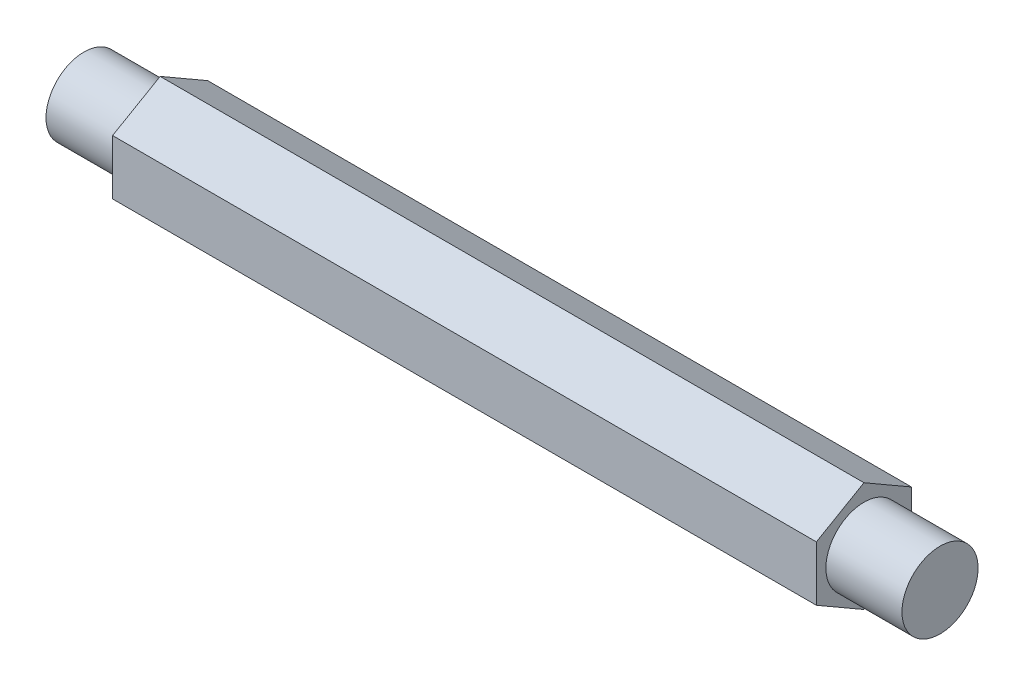
ISO-10303-21;
HEADER;
FILE_DESCRIPTION(('STEP AP214'),'2;1');
FILE_NAME('part.step','',(''),(''),'','','');
FILE_SCHEMA(('AUTOMOTIVE_DESIGN { 1 0 10303 214 1 1 1 1 }'));
ENDSEC;
DATA;
#1=APPLICATION_CONTEXT('core data for automotive mechanical design processes');
#2=APPLICATION_PROTOCOL_DEFINITION('international standard','automotive_design',2000,#1);
#3=PRODUCT_CONTEXT('',#1,'mechanical');
#4=PRODUCT('Part','Part','',(#3));
#5=PRODUCT_RELATED_PRODUCT_CATEGORY('part','',(#4));
#6=PRODUCT_DEFINITION_FORMATION('','',#4);
#7=PRODUCT_DEFINITION_CONTEXT('part definition',#1,'design');
#8=PRODUCT_DEFINITION('design','',#6,#7);
#9=PRODUCT_DEFINITION_SHAPE('','',#8);
#10=(LENGTH_UNIT() NAMED_UNIT(*) SI_UNIT(.MILLI.,.METRE.));
#11=(NAMED_UNIT(*) PLANE_ANGLE_UNIT() SI_UNIT($,.RADIAN.));
#12=(NAMED_UNIT(*) SI_UNIT($,.STERADIAN.) SOLID_ANGLE_UNIT());
#13=UNCERTAINTY_MEASURE_WITH_UNIT(LENGTH_MEASURE(1.E-05),#10,'distance_accuracy_value','');
#14=(GEOMETRIC_REPRESENTATION_CONTEXT(3) GLOBAL_UNCERTAINTY_ASSIGNED_CONTEXT((#13)) GLOBAL_UNIT_ASSIGNED_CONTEXT((#10,
#11,#12)) REPRESENTATION_CONTEXT('',''));
#15=CARTESIAN_POINT('',(0.,0.,0.));
#16=DIRECTION('',(0.,0.,1.));
#17=DIRECTION('',(1.,0.,0.));
#18=AXIS2_PLACEMENT_3D('',#15,#16,#17);
#19=CARTESIAN_POINT('',(0.,2.5,0.));
#20=DIRECTION('',(1.,0.,0.));
#21=DIRECTION('',(0.,0.,-1.));
#22=AXIS2_PLACEMENT_3D('',#19,#20,#21);
#23=PLANE('',#22);
#24=CARTESIAN_POINT('',(0.,0.,0.));
#25=DIRECTION('',(-1.,0.,0.));
#26=DIRECTION('',(0.,0.,1.));
#27=AXIS2_PLACEMENT_3D('',#24,#25,#26);
#28=CIRCLE('',#27,2.);
#29=CARTESIAN_POINT('',(0.,0.,2.));
#30=VERTEX_POINT('',#29);
#31=EDGE_CURVE('E123',#30,#30,#28,.T.);
#32=ORIENTED_EDGE('',*,*,#31,.F.);
#33=EDGE_LOOP('',(#32));
#34=FACE_BOUND('',#33,.T.);
#35=DIRECTION('',(0.,-1.,0.));
#36=VECTOR('',#35,1.);
#37=CARTESIAN_POINT('',(0.,1.44337567297406,2.5));
#38=LINE('',#37,#36);
#39=CARTESIAN_POINT('',(0.,1.44337567297406,2.5));
#40=VERTEX_POINT('',#39);
#41=CARTESIAN_POINT('',(0.,-1.44337567297406,2.5));
#42=VERTEX_POINT('',#41);
#43=EDGE_CURVE('E98',#40,#42,#38,.T.);
#44=ORIENTED_EDGE('',*,*,#43,.F.);
#45=DIRECTION('',(0.,-0.5,0.866025403784439));
#46=VECTOR('',#45,1.);
#47=CARTESIAN_POINT('',(0.,2.88675134594813,0.));
#48=LINE('',#47,#46);
#49=CARTESIAN_POINT('',(0.,2.88675134594813,0.));
#50=VERTEX_POINT('',#49);
#51=EDGE_CURVE('E93',#50,#40,#48,.T.);
#52=ORIENTED_EDGE('',*,*,#51,.F.);
#53=DIRECTION('',(0.,0.5,0.866025403784439));
#54=VECTOR('',#53,1.);
#55=CARTESIAN_POINT('',(0.,1.44337567297406,-2.5));
#56=LINE('',#55,#54);
#57=CARTESIAN_POINT('',(0.,1.44337567297406,-2.5));
#58=VERTEX_POINT('',#57);
#59=EDGE_CURVE('E95',#58,#50,#56,.T.);
#60=ORIENTED_EDGE('',*,*,#59,.F.);
#61=DIRECTION('',(0.,1.,0.));
#62=VECTOR('',#61,1.);
#63=CARTESIAN_POINT('',(0.,-1.44337567297406,-2.5));
#64=LINE('',#63,#62);
#65=CARTESIAN_POINT('',(0.,-1.44337567297406,-2.5));
#66=VERTEX_POINT('',#65);
#67=EDGE_CURVE('E198',#66,#58,#64,.T.);
#68=ORIENTED_EDGE('',*,*,#67,.F.);
#69=DIRECTION('',(0.,0.5,-0.866025403784439));
#70=VECTOR('',#69,1.);
#71=CARTESIAN_POINT('',(0.,-2.88675134594813,0.));
#72=LINE('',#71,#70);
#73=CARTESIAN_POINT('',(0.,-2.88675134594813,0.));
#74=VERTEX_POINT('',#73);
#75=EDGE_CURVE('E200',#74,#66,#72,.T.);
#76=ORIENTED_EDGE('',*,*,#75,.F.);
#77=DIRECTION('',(0.,-0.5,-0.866025403784439));
#78=VECTOR('',#77,1.);
#79=CARTESIAN_POINT('',(0.,-1.44337567297406,2.5));
#80=LINE('',#79,#78);
#81=EDGE_CURVE('E193',#42,#74,#80,.T.);
#82=ORIENTED_EDGE('',*,*,#81,.F.);
#83=EDGE_LOOP('',(#44,#52,#60,#68,#76,#82));
#84=FACE_BOUND('',#83,.T.);
#85=ADVANCED_FACE('F39',(#34,#84),#23,.F.);
#86=CARTESIAN_POINT('',(-4.,2.,0.));
#87=DIRECTION('',(1.,0.,0.));
#88=DIRECTION('',(0.,0.,-1.));
#89=AXIS2_PLACEMENT_3D('',#86,#87,#88);
#90=PLANE('',#89);
#91=CARTESIAN_POINT('',(-4.,0.,0.));
#92=DIRECTION('',(-1.,0.,0.));
#93=DIRECTION('',(0.,0.,1.));
#94=AXIS2_PLACEMENT_3D('',#91,#92,#93);
#95=CIRCLE('',#94,2.);
#96=CARTESIAN_POINT('',(-4.,0.,2.));
#97=VERTEX_POINT('',#96);
#98=EDGE_CURVE('E126',#97,#97,#95,.T.);
#99=ORIENTED_EDGE('',*,*,#98,.T.);
#100=EDGE_LOOP('',(#99));
#101=FACE_BOUND('',#100,.T.);
#102=ADVANCED_FACE('F147',(#101),#90,.F.);
#103=CARTESIAN_POINT('',(-6.18518518518519,0.,0.));
#104=DIRECTION('',(-1.,0.,0.));
#105=DIRECTION('',(0.,0.,1.));
#106=AXIS2_PLACEMENT_3D('',#103,#104,#105);
#107=CYLINDRICAL_SURFACE('',#106,2.);
#108=ORIENTED_EDGE('',*,*,#98,.F.);
#109=EDGE_LOOP('',(#108));
#110=FACE_BOUND('',#109,.T.);
#111=ORIENTED_EDGE('',*,*,#31,.T.);
#112=EDGE_LOOP('',(#111));
#113=FACE_BOUND('',#112,.T.);
#114=ADVANCED_FACE('F152',(#110,#113),#107,.T.);
#115=CARTESIAN_POINT('',(44.6376261582595,-1.44337567297406,-2.5));
#116=DIRECTION('',(0.,0.,1.));
#117=DIRECTION('',(1.,0.,0.));
#118=AXIS2_PLACEMENT_3D('',#115,#116,#117);
#119=PLANE('',#118);
#120=DIRECTION('',(0.,-1.,0.));
#121=VECTOR('',#120,1.);
#122=CARTESIAN_POINT('',(36.9999999999998,-1.44337567297406,-2.5));
#123=LINE('',#122,#121);
#124=CARTESIAN_POINT('',(36.9999999999998,1.44337567297406,-2.5));
#125=VERTEX_POINT('',#124);
#126=CARTESIAN_POINT('',(36.9999999999998,-1.44337567297406,-2.5));
#127=VERTEX_POINT('',#126);
#128=EDGE_CURVE('E114',#125,#127,#123,.T.);
#129=ORIENTED_EDGE('',*,*,#128,.T.);
#130=DIRECTION('',(-1.,0.,0.));
#131=VECTOR('',#130,1.);
#132=CARTESIAN_POINT('',(44.6376261582595,-1.44337567297406,-2.5));
#133=LINE('',#132,#131);
#134=EDGE_CURVE('E186',#127,#66,#133,.T.);
#135=ORIENTED_EDGE('',*,*,#134,.T.);
#136=ORIENTED_EDGE('',*,*,#67,.T.);
#137=DIRECTION('',(-1.,0.,0.));
#138=VECTOR('',#137,1.);
#139=CARTESIAN_POINT('',(44.6376261582595,1.44337567297406,-2.5));
#140=LINE('',#139,#138);
#141=EDGE_CURVE('E109',#125,#58,#140,.T.);
#142=ORIENTED_EDGE('',*,*,#141,.F.);
#143=EDGE_LOOP('',(#129,#135,#136,#142));
#144=FACE_BOUND('',#143,.T.);
#145=ADVANCED_FACE('F157',(#144),#119,.F.);
#146=CARTESIAN_POINT('',(44.6376261582595,-2.88675134594813,0.));
#147=DIRECTION('',(0.,0.866025403784439,0.5));
#148=DIRECTION('',(0.,-0.5,0.866025403784439));
#149=AXIS2_PLACEMENT_3D('',#146,#147,#148);
#150=PLANE('',#149);
#151=DIRECTION('',(0.,-0.5,0.866025403784439));
#152=VECTOR('',#151,1.);
#153=CARTESIAN_POINT('',(36.9999999999998,-2.88675134594813,0.));
#154=LINE('',#153,#152);
#155=CARTESIAN_POINT('',(36.9999999999998,-2.88675134594813,0.));
#156=VERTEX_POINT('',#155);
#157=EDGE_CURVE('E117',#127,#156,#154,.T.);
#158=ORIENTED_EDGE('',*,*,#157,.T.);
#159=DIRECTION('',(-1.,0.,0.));
#160=VECTOR('',#159,1.);
#161=CARTESIAN_POINT('',(44.6376261582595,-2.88675134594813,0.));
#162=LINE('',#161,#160);
#163=EDGE_CURVE('E184',#156,#74,#162,.T.);
#164=ORIENTED_EDGE('',*,*,#163,.T.);
#165=ORIENTED_EDGE('',*,*,#75,.T.);
#166=ORIENTED_EDGE('',*,*,#134,.F.);
#167=EDGE_LOOP('',(#158,#164,#165,#166));
#168=FACE_BOUND('',#167,.T.);
#169=ADVANCED_FACE('F163',(#168),#150,.F.);
#170=CARTESIAN_POINT('',(44.6376261582595,-1.44337567297406,2.5));
#171=DIRECTION('',(0.,0.866025403784439,-0.5));
#172=DIRECTION('',(0.,0.5,0.866025403784439));
#173=AXIS2_PLACEMENT_3D('',#170,#171,#172);
#174=PLANE('',#173);
#175=DIRECTION('',(0.,0.5,0.866025403784439));
#176=VECTOR('',#175,1.);
#177=CARTESIAN_POINT('',(36.9999999999998,-1.44337567297406,2.5));
#178=LINE('',#177,#176);
#179=CARTESIAN_POINT('',(36.9999999999998,-1.44337567297406,2.5));
#180=VERTEX_POINT('',#179);
#181=EDGE_CURVE('E61',#156,#180,#178,.T.);
#182=ORIENTED_EDGE('',*,*,#181,.T.);
#183=DIRECTION('',(-1.,0.,0.));
#184=VECTOR('',#183,1.);
#185=CARTESIAN_POINT('',(44.6376261582595,-1.44337567297406,2.5));
#186=LINE('',#185,#184);
#187=EDGE_CURVE('E119',#180,#42,#186,.T.);
#188=ORIENTED_EDGE('',*,*,#187,.T.);
#189=ORIENTED_EDGE('',*,*,#81,.T.);
#190=ORIENTED_EDGE('',*,*,#163,.F.);
#191=EDGE_LOOP('',(#182,#188,#189,#190));
#192=FACE_BOUND('',#191,.T.);
#193=ADVANCED_FACE('F173',(#192),#174,.F.);
#194=CARTESIAN_POINT('',(44.6376261582595,1.44337567297406,2.5));
#195=DIRECTION('',(0.,0.,-1.));
#196=DIRECTION('',(0.,1.,0.));
#197=AXIS2_PLACEMENT_3D('',#194,#195,#196);
#198=PLANE('',#197);
#199=DIRECTION('',(0.,1.,0.));
#200=VECTOR('',#199,1.);
#201=CARTESIAN_POINT('',(36.9999999999998,1.44337567297406,2.5));
#202=LINE('',#201,#200);
#203=CARTESIAN_POINT('',(36.9999999999998,1.44337567297406,2.5));
#204=VERTEX_POINT('',#203);
#205=EDGE_CURVE('E53',#180,#204,#202,.T.);
#206=ORIENTED_EDGE('',*,*,#205,.T.);
#207=DIRECTION('',(-1.,0.,0.));
#208=VECTOR('',#207,1.);
#209=CARTESIAN_POINT('',(44.6376261582595,1.44337567297406,2.5));
#210=LINE('',#209,#208);
#211=EDGE_CURVE('E115',#204,#40,#210,.T.);
#212=ORIENTED_EDGE('',*,*,#211,.T.);
#213=ORIENTED_EDGE('',*,*,#43,.T.);
#214=ORIENTED_EDGE('',*,*,#187,.F.);
#215=EDGE_LOOP('',(#206,#212,#213,#214));
#216=FACE_BOUND('',#215,.T.);
#217=ADVANCED_FACE('F170',(#216),#198,.F.);
#218=CARTESIAN_POINT('',(44.6376261582595,2.88675134594813,0.));
#219=DIRECTION('',(0.,-0.866025403784439,-0.5));
#220=DIRECTION('',(0.,0.5,-0.866025403784439));
#221=AXIS2_PLACEMENT_3D('',#218,#219,#220);
#222=PLANE('',#221);
#223=DIRECTION('',(0.,0.5,-0.866025403784439));
#224=VECTOR('',#223,1.);
#225=CARTESIAN_POINT('',(36.9999999999998,2.88675134594813,0.));
#226=LINE('',#225,#224);
#227=CARTESIAN_POINT('',(36.9999999999998,2.88675134594813,0.));
#228=VERTEX_POINT('',#227);
#229=EDGE_CURVE('E112',#204,#228,#226,.T.);
#230=ORIENTED_EDGE('',*,*,#229,.T.);
#231=DIRECTION('',(-1.,0.,0.));
#232=VECTOR('',#231,1.);
#233=CARTESIAN_POINT('',(44.6376261582595,2.88675134594813,0.));
#234=LINE('',#233,#232);
#235=EDGE_CURVE('E107',#228,#50,#234,.T.);
#236=ORIENTED_EDGE('',*,*,#235,.T.);
#237=ORIENTED_EDGE('',*,*,#51,.T.);
#238=ORIENTED_EDGE('',*,*,#211,.F.);
#239=EDGE_LOOP('',(#230,#236,#237,#238));
#240=FACE_BOUND('',#239,.T.);
#241=ADVANCED_FACE('F111',(#240),#222,.F.);
#242=CARTESIAN_POINT('',(44.6376261582595,1.44337567297406,-2.5));
#243=DIRECTION('',(0.,-0.866025403784439,0.5));
#244=DIRECTION('',(0.,-0.5,-0.866025403784439));
#245=AXIS2_PLACEMENT_3D('',#242,#243,#244);
#246=PLANE('',#245);
#247=DIRECTION('',(0.,-0.5,-0.866025403784439));
#248=VECTOR('',#247,1.);
#249=CARTESIAN_POINT('',(36.9999999999998,1.44337567297406,-2.5));
#250=LINE('',#249,#248);
#251=EDGE_CURVE('E127',#228,#125,#250,.T.);
#252=ORIENTED_EDGE('',*,*,#251,.T.);
#253=ORIENTED_EDGE('',*,*,#141,.T.);
#254=ORIENTED_EDGE('',*,*,#59,.T.);
#255=ORIENTED_EDGE('',*,*,#235,.F.);
#256=EDGE_LOOP('',(#252,#253,#254,#255));
#257=FACE_BOUND('',#256,.T.);
#258=ADVANCED_FACE('F106',(#257),#246,.F.);
#259=CARTESIAN_POINT('',(40.9999999999998,0.,0.));
#260=DIRECTION('',(-1.,0.,0.));
#261=DIRECTION('',(0.,0.,1.));
#262=AXIS2_PLACEMENT_3D('',#259,#260,#261);
#263=PLANE('',#262);
#264=CARTESIAN_POINT('',(40.9999999999998,0.,0.));
#265=DIRECTION('',(-1.,0.,0.));
#266=DIRECTION('',(0.,0.,1.));
#267=AXIS2_PLACEMENT_3D('',#264,#265,#266);
#268=CIRCLE('',#267,2.);
#269=CARTESIAN_POINT('',(40.9999999999998,0.,2.));
#270=VERTEX_POINT('',#269);
#271=EDGE_CURVE('E46',#270,#270,#268,.T.);
#272=ORIENTED_EDGE('',*,*,#271,.F.);
#273=EDGE_LOOP('',(#272));
#274=FACE_BOUND('',#273,.T.);
#275=ADVANCED_FACE('F134',(#274),#263,.F.);
#276=CARTESIAN_POINT('',(-6.18518518518519,0.,0.));
#277=DIRECTION('',(-1.,0.,0.));
#278=DIRECTION('',(0.,0.,1.));
#279=AXIS2_PLACEMENT_3D('',#276,#277,#278);
#280=CYLINDRICAL_SURFACE('',#279,2.);
#281=CARTESIAN_POINT('',(36.9999999999998,0.,0.));
#282=DIRECTION('',(-1.,0.,0.));
#283=DIRECTION('',(0.,0.,1.));
#284=AXIS2_PLACEMENT_3D('',#281,#282,#283);
#285=CIRCLE('',#284,2.);
#286=CARTESIAN_POINT('',(36.9999999999998,0.,2.));
#287=VERTEX_POINT('',#286);
#288=EDGE_CURVE('E11',#287,#287,#285,.T.);
#289=ORIENTED_EDGE('',*,*,#288,.F.);
#290=EDGE_LOOP('',(#289));
#291=FACE_BOUND('',#290,.T.);
#292=ORIENTED_EDGE('',*,*,#271,.T.);
#293=EDGE_LOOP('',(#292));
#294=FACE_BOUND('',#293,.T.);
#295=ADVANCED_FACE('F132',(#291,#294),#280,.T.);
#296=CARTESIAN_POINT('',(36.9999999999998,2.,0.));
#297=DIRECTION('',(-1.,0.,0.));
#298=DIRECTION('',(0.,0.,1.));
#299=AXIS2_PLACEMENT_3D('',#296,#297,#298);
#300=PLANE('',#299);
#301=ORIENTED_EDGE('',*,*,#251,.F.);
#302=ORIENTED_EDGE('',*,*,#229,.F.);
#303=ORIENTED_EDGE('',*,*,#205,.F.);
#304=ORIENTED_EDGE('',*,*,#181,.F.);
#305=ORIENTED_EDGE('',*,*,#157,.F.);
#306=ORIENTED_EDGE('',*,*,#128,.F.);
#307=EDGE_LOOP('',(#301,#302,#303,#304,#305,#306));
#308=FACE_BOUND('',#307,.T.);
#309=ORIENTED_EDGE('',*,*,#288,.T.);
#310=EDGE_LOOP('',(#309));
#311=FACE_BOUND('',#310,.T.);
#312=ADVANCED_FACE('F141',(#308,#311),#300,.F.);
#313=CLOSED_SHELL('',(#85,#102,#114,#145,#169,#193,#217,#241,#258,#275,#295,#312));
#314=MANIFOLD_SOLID_BREP('B2',#313);
#315=ADVANCED_BREP_SHAPE_REPRESENTATION('',(#18,#314),#14);
#316=SHAPE_DEFINITION_REPRESENTATION(#9,#315);
ENDSEC;
END-ISO-10303-21;
